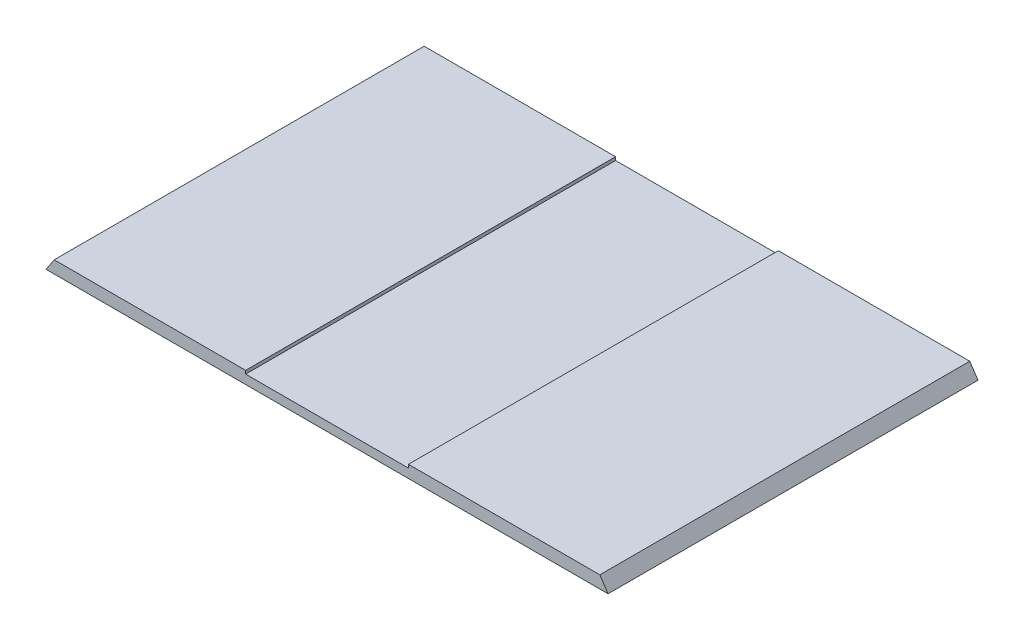
ISO-10303-21;
HEADER;
FILE_DESCRIPTION(('STEP AP214'),'2;1');
FILE_NAME('part.step','',(''),(''),'','','');
FILE_SCHEMA(('AUTOMOTIVE_DESIGN { 1 0 10303 214 1 1 1 1 }'));
ENDSEC;
DATA;
#1=APPLICATION_CONTEXT('core data for automotive mechanical design processes');
#2=APPLICATION_PROTOCOL_DEFINITION('international standard','automotive_design',2000,#1);
#3=PRODUCT_CONTEXT('',#1,'mechanical');
#4=PRODUCT('Part','Part','',(#3));
#5=PRODUCT_RELATED_PRODUCT_CATEGORY('part','',(#4));
#6=PRODUCT_DEFINITION_FORMATION('','',#4);
#7=PRODUCT_DEFINITION_CONTEXT('part definition',#1,'design');
#8=PRODUCT_DEFINITION('design','',#6,#7);
#9=PRODUCT_DEFINITION_SHAPE('','',#8);
#10=(LENGTH_UNIT() NAMED_UNIT(*) SI_UNIT(.MILLI.,.METRE.));
#11=(NAMED_UNIT(*) PLANE_ANGLE_UNIT() SI_UNIT($,.RADIAN.));
#12=(NAMED_UNIT(*) SI_UNIT($,.STERADIAN.) SOLID_ANGLE_UNIT());
#13=UNCERTAINTY_MEASURE_WITH_UNIT(LENGTH_MEASURE(1.E-05),#10,'distance_accuracy_value','');
#14=(GEOMETRIC_REPRESENTATION_CONTEXT(3) GLOBAL_UNCERTAINTY_ASSIGNED_CONTEXT((#13)) GLOBAL_UNIT_ASSIGNED_CONTEXT((#10,
#11,#12)) REPRESENTATION_CONTEXT('',''));
#15=CARTESIAN_POINT('',(0.,0.,0.));
#16=DIRECTION('',(0.,0.,1.));
#17=DIRECTION('',(1.,0.,0.));
#18=AXIS2_PLACEMENT_3D('',#15,#16,#17);
#19=CARTESIAN_POINT('',(341.858259493534,-194.367647058824,450.));
#20=DIRECTION('',(0.,1.,0.));
#21=DIRECTION('',(-1.,0.,0.));
#22=AXIS2_PLACEMENT_3D('',#19,#20,#21);
#23=PLANE('',#22);
#24=DIRECTION('',(1.,0.,0.));
#25=VECTOR('',#24,1.);
#26=CARTESIAN_POINT('',(341.858259493534,-194.367647058824,0.));
#27=LINE('',#26,#25);
#28=CARTESIAN_POINT('',(-341.858259493534,-194.367647058824,0.));
#29=VERTEX_POINT('',#28);
#30=CARTESIAN_POINT('',(341.858259493534,-194.367647058824,0.));
#31=VERTEX_POINT('',#30);
#32=EDGE_CURVE('E129',#29,#31,#27,.T.);
#33=ORIENTED_EDGE('',*,*,#32,.T.);
#34=DIRECTION('',(0.,0.,-1.));
#35=VECTOR('',#34,1.);
#36=CARTESIAN_POINT('',(341.858259493534,-194.367647058824,450.));
#37=LINE('',#36,#35);
#38=CARTESIAN_POINT('',(341.858259493534,-194.367647058824,450.));
#39=VERTEX_POINT('',#38);
#40=EDGE_CURVE('E11',#39,#31,#37,.T.);
#41=ORIENTED_EDGE('',*,*,#40,.F.);
#42=DIRECTION('',(1.,0.,0.));
#43=VECTOR('',#42,1.);
#44=CARTESIAN_POINT('',(341.858259493534,-194.367647058824,450.));
#45=LINE('',#44,#43);
#46=CARTESIAN_POINT('',(-341.858259493534,-194.367647058824,450.));
#47=VERTEX_POINT('',#46);
#48=EDGE_CURVE('E143',#47,#39,#45,.T.);
#49=ORIENTED_EDGE('',*,*,#48,.F.);
#50=DIRECTION('',(0.,0.,-1.));
#51=VECTOR('',#50,1.);
#52=CARTESIAN_POINT('',(-341.858259493534,-194.367647058824,450.));
#53=LINE('',#52,#51);
#54=EDGE_CURVE('E125',#47,#29,#53,.T.);
#55=ORIENTED_EDGE('',*,*,#54,.T.);
#56=EDGE_LOOP('',(#33,#41,#49,#55));
#57=FACE_BOUND('',#56,.T.);
#58=ADVANCED_FACE('F33',(#57),#23,.F.);
#59=CARTESIAN_POINT('',(331.858259493534,-179.367647058824,450.));
#60=DIRECTION('',(-0.832050294337846,-0.554700196225225,0.));
#61=DIRECTION('',(0.554700196225225,-0.832050294337847,0.));
#62=AXIS2_PLACEMENT_3D('',#59,#60,#61);
#63=PLANE('',#62);
#64=DIRECTION('',(-0.554700196225225,0.832050294337846,0.));
#65=VECTOR('',#64,1.);
#66=CARTESIAN_POINT('',(331.858259493534,-179.367647058824,0.));
#67=LINE('',#66,#65);
#68=CARTESIAN_POINT('',(331.858259493534,-179.367647058824,0.));
#69=VERTEX_POINT('',#68);
#70=EDGE_CURVE('E132',#31,#69,#67,.T.);
#71=ORIENTED_EDGE('',*,*,#70,.T.);
#72=DIRECTION('',(0.,0.,-1.));
#73=VECTOR('',#72,1.);
#74=CARTESIAN_POINT('',(331.858259493534,-179.367647058824,450.));
#75=LINE('',#74,#73);
#76=CARTESIAN_POINT('',(331.858259493534,-179.367647058824,450.));
#77=VERTEX_POINT('',#76);
#78=EDGE_CURVE('E41',#77,#69,#75,.T.);
#79=ORIENTED_EDGE('',*,*,#78,.F.);
#80=DIRECTION('',(-0.554700196225225,0.832050294337846,0.));
#81=VECTOR('',#80,1.);
#82=CARTESIAN_POINT('',(331.858259493534,-179.367647058824,450.));
#83=LINE('',#82,#81);
#84=EDGE_CURVE('E92',#39,#77,#83,.T.);
#85=ORIENTED_EDGE('',*,*,#84,.F.);
#86=ORIENTED_EDGE('',*,*,#40,.T.);
#87=EDGE_LOOP('',(#71,#79,#85,#86));
#88=FACE_BOUND('',#87,.T.);
#89=ADVANCED_FACE('F178',(#88),#63,.F.);
#90=CARTESIAN_POINT('',(98.9999999999999,-179.367647058824,450.));
#91=DIRECTION('',(0.,-1.,0.));
#92=DIRECTION('',(1.,0.,0.));
#93=AXIS2_PLACEMENT_3D('',#90,#91,#92);
#94=PLANE('',#93);
#95=DIRECTION('',(-1.,0.,0.));
#96=VECTOR('',#95,1.);
#97=CARTESIAN_POINT('',(98.9999999999999,-179.367647058824,0.));
#98=LINE('',#97,#96);
#99=CARTESIAN_POINT('',(98.9999999999999,-179.367647058824,0.));
#100=VERTEX_POINT('',#99);
#101=EDGE_CURVE('E134',#69,#100,#98,.T.);
#102=ORIENTED_EDGE('',*,*,#101,.T.);
#103=DIRECTION('',(0.,0.,-1.));
#104=VECTOR('',#103,1.);
#105=CARTESIAN_POINT('',(98.9999999999999,-179.367647058824,450.));
#106=LINE('',#105,#104);
#107=CARTESIAN_POINT('',(98.9999999999999,-179.367647058824,450.));
#108=VERTEX_POINT('',#107);
#109=EDGE_CURVE('E150',#108,#100,#106,.T.);
#110=ORIENTED_EDGE('',*,*,#109,.F.);
#111=DIRECTION('',(-1.,0.,0.));
#112=VECTOR('',#111,1.);
#113=CARTESIAN_POINT('',(98.9999999999999,-179.367647058824,450.));
#114=LINE('',#113,#112);
#115=EDGE_CURVE('E158',#77,#108,#114,.T.);
#116=ORIENTED_EDGE('',*,*,#115,.F.);
#117=ORIENTED_EDGE('',*,*,#78,.T.);
#118=EDGE_LOOP('',(#102,#110,#116,#117));
#119=FACE_BOUND('',#118,.T.);
#120=ADVANCED_FACE('F156',(#119),#94,.F.);
#121=CARTESIAN_POINT('',(98.9999999999999,-179.367647058824,450.));
#122=DIRECTION('',(1.,0.,0.));
#123=DIRECTION('',(0.,0.,-1.));
#124=AXIS2_PLACEMENT_3D('',#121,#122,#123);
#125=PLANE('',#124);
#126=DIRECTION('',(0.,-1.,0.));
#127=VECTOR('',#126,1.);
#128=CARTESIAN_POINT('',(98.9999999999999,-179.367647058824,0.));
#129=LINE('',#128,#127);
#130=CARTESIAN_POINT('',(98.9999999999999,-183.367647058824,0.));
#131=VERTEX_POINT('',#130);
#132=EDGE_CURVE('E136',#100,#131,#129,.T.);
#133=ORIENTED_EDGE('',*,*,#132,.T.);
#134=DIRECTION('',(0.,0.,-1.));
#135=VECTOR('',#134,1.);
#136=CARTESIAN_POINT('',(98.9999999999999,-183.367647058824,450.));
#137=LINE('',#136,#135);
#138=CARTESIAN_POINT('',(98.9999999999999,-183.367647058824,450.));
#139=VERTEX_POINT('',#138);
#140=EDGE_CURVE('E147',#139,#131,#137,.T.);
#141=ORIENTED_EDGE('',*,*,#140,.F.);
#142=DIRECTION('',(0.,-1.,0.));
#143=VECTOR('',#142,1.);
#144=CARTESIAN_POINT('',(98.9999999999999,-179.367647058824,450.));
#145=LINE('',#144,#143);
#146=EDGE_CURVE('E170',#108,#139,#145,.T.);
#147=ORIENTED_EDGE('',*,*,#146,.F.);
#148=ORIENTED_EDGE('',*,*,#109,.T.);
#149=EDGE_LOOP('',(#133,#141,#147,#148));
#150=FACE_BOUND('',#149,.T.);
#151=ADVANCED_FACE('F166',(#150),#125,.F.);
#152=CARTESIAN_POINT('',(-98.9999999999999,-183.367647058824,450.));
#153=DIRECTION('',(0.,-1.,0.));
#154=DIRECTION('',(0.,0.,-1.));
#155=AXIS2_PLACEMENT_3D('',#152,#153,#154);
#156=PLANE('',#155);
#157=DIRECTION('',(-1.,0.,0.));
#158=VECTOR('',#157,1.);
#159=CARTESIAN_POINT('',(-98.9999999999999,-183.367647058824,0.));
#160=LINE('',#159,#158);
#161=CARTESIAN_POINT('',(-98.9999999999999,-183.367647058824,0.));
#162=VERTEX_POINT('',#161);
#163=EDGE_CURVE('E138',#131,#162,#160,.T.);
#164=ORIENTED_EDGE('',*,*,#163,.T.);
#165=DIRECTION('',(0.,0.,-1.));
#166=VECTOR('',#165,1.);
#167=CARTESIAN_POINT('',(-98.9999999999999,-183.367647058824,450.));
#168=LINE('',#167,#166);
#169=CARTESIAN_POINT('',(-98.9999999999999,-183.367647058824,450.));
#170=VERTEX_POINT('',#169);
#171=EDGE_CURVE('E120',#170,#162,#168,.T.);
#172=ORIENTED_EDGE('',*,*,#171,.F.);
#173=DIRECTION('',(-1.,0.,0.));
#174=VECTOR('',#173,1.);
#175=CARTESIAN_POINT('',(-98.9999999999999,-183.367647058824,450.));
#176=LINE('',#175,#174);
#177=EDGE_CURVE('E111',#139,#170,#176,.T.);
#178=ORIENTED_EDGE('',*,*,#177,.F.);
#179=ORIENTED_EDGE('',*,*,#140,.T.);
#180=EDGE_LOOP('',(#164,#172,#178,#179));
#181=FACE_BOUND('',#180,.T.);
#182=ADVANCED_FACE('F169',(#181),#156,.F.);
#183=CARTESIAN_POINT('',(-98.9999999999999,-179.367647058824,450.));
#184=DIRECTION('',(-1.,0.,0.));
#185=DIRECTION('',(0.,0.,1.));
#186=AXIS2_PLACEMENT_3D('',#183,#184,#185);
#187=PLANE('',#186);
#188=DIRECTION('',(0.,1.,0.));
#189=VECTOR('',#188,1.);
#190=CARTESIAN_POINT('',(-98.9999999999999,-179.367647058824,0.));
#191=LINE('',#190,#189);
#192=CARTESIAN_POINT('',(-98.9999999999999,-179.367647058824,0.));
#193=VERTEX_POINT('',#192);
#194=EDGE_CURVE('E119',#162,#193,#191,.T.);
#195=ORIENTED_EDGE('',*,*,#194,.T.);
#196=DIRECTION('',(0.,0.,-1.));
#197=VECTOR('',#196,1.);
#198=CARTESIAN_POINT('',(-98.9999999999999,-179.367647058824,450.));
#199=LINE('',#198,#197);
#200=CARTESIAN_POINT('',(-98.9999999999999,-179.367647058824,450.));
#201=VERTEX_POINT('',#200);
#202=EDGE_CURVE('E116',#201,#193,#199,.T.);
#203=ORIENTED_EDGE('',*,*,#202,.F.);
#204=DIRECTION('',(0.,1.,0.));
#205=VECTOR('',#204,1.);
#206=CARTESIAN_POINT('',(-98.9999999999999,-179.367647058824,450.));
#207=LINE('',#206,#205);
#208=EDGE_CURVE('E105',#170,#201,#207,.T.);
#209=ORIENTED_EDGE('',*,*,#208,.F.);
#210=ORIENTED_EDGE('',*,*,#171,.T.);
#211=EDGE_LOOP('',(#195,#203,#209,#210));
#212=FACE_BOUND('',#211,.T.);
#213=ADVANCED_FACE('F117',(#212),#187,.F.);
#214=CARTESIAN_POINT('',(-98.9999999999999,-179.367647058824,450.));
#215=DIRECTION('',(0.,-1.,0.));
#216=DIRECTION('',(1.,0.,0.));
#217=AXIS2_PLACEMENT_3D('',#214,#215,#216);
#218=PLANE('',#217);
#219=DIRECTION('',(-1.,0.,0.));
#220=VECTOR('',#219,1.);
#221=CARTESIAN_POINT('',(-98.9999999999999,-179.367647058824,0.));
#222=LINE('',#221,#220);
#223=CARTESIAN_POINT('',(-331.858259493534,-179.367647058824,0.));
#224=VERTEX_POINT('',#223);
#225=EDGE_CURVE('E78',#193,#224,#222,.T.);
#226=ORIENTED_EDGE('',*,*,#225,.T.);
#227=DIRECTION('',(0.,0.,-1.));
#228=VECTOR('',#227,1.);
#229=CARTESIAN_POINT('',(-331.858259493534,-179.367647058824,450.));
#230=LINE('',#229,#228);
#231=CARTESIAN_POINT('',(-331.858259493534,-179.367647058824,450.));
#232=VERTEX_POINT('',#231);
#233=EDGE_CURVE('E121',#232,#224,#230,.T.);
#234=ORIENTED_EDGE('',*,*,#233,.F.);
#235=DIRECTION('',(-1.,0.,0.));
#236=VECTOR('',#235,1.);
#237=CARTESIAN_POINT('',(-98.9999999999999,-179.367647058824,450.));
#238=LINE('',#237,#236);
#239=EDGE_CURVE('E109',#201,#232,#238,.T.);
#240=ORIENTED_EDGE('',*,*,#239,.F.);
#241=ORIENTED_EDGE('',*,*,#202,.T.);
#242=EDGE_LOOP('',(#226,#234,#240,#241));
#243=FACE_BOUND('',#242,.T.);
#244=ADVANCED_FACE('F123',(#243),#218,.F.);
#245=CARTESIAN_POINT('',(-331.858259493534,-179.367647058824,450.));
#246=DIRECTION('',(0.832050294337846,-0.554700196225225,0.));
#247=DIRECTION('',(0.554700196225225,0.832050294337847,0.));
#248=AXIS2_PLACEMENT_3D('',#245,#246,#247);
#249=PLANE('',#248);
#250=DIRECTION('',(-0.554700196225225,-0.832050294337846,0.));
#251=VECTOR('',#250,1.);
#252=CARTESIAN_POINT('',(-331.858259493534,-179.367647058824,0.));
#253=LINE('',#252,#251);
#254=EDGE_CURVE('E84',#224,#29,#253,.T.);
#255=ORIENTED_EDGE('',*,*,#254,.T.);
#256=ORIENTED_EDGE('',*,*,#54,.F.);
#257=DIRECTION('',(-0.554700196225225,-0.832050294337846,0.));
#258=VECTOR('',#257,1.);
#259=CARTESIAN_POINT('',(-331.858259493534,-179.367647058824,450.));
#260=LINE('',#259,#258);
#261=EDGE_CURVE('E49',#232,#47,#260,.T.);
#262=ORIENTED_EDGE('',*,*,#261,.F.);
#263=ORIENTED_EDGE('',*,*,#233,.T.);
#264=EDGE_LOOP('',(#255,#256,#262,#263));
#265=FACE_BOUND('',#264,.T.);
#266=ADVANCED_FACE('F194',(#265),#249,.F.);
#267=CARTESIAN_POINT('',(0.,0.,450.));
#268=DIRECTION('',(0.,0.,1.));
#269=DIRECTION('',(1.,0.,0.));
#270=AXIS2_PLACEMENT_3D('',#267,#268,#269);
#271=PLANE('',#270);
#272=ORIENTED_EDGE('',*,*,#48,.T.);
#273=ORIENTED_EDGE('',*,*,#84,.T.);
#274=ORIENTED_EDGE('',*,*,#115,.T.);
#275=ORIENTED_EDGE('',*,*,#146,.T.);
#276=ORIENTED_EDGE('',*,*,#177,.T.);
#277=ORIENTED_EDGE('',*,*,#208,.T.);
#278=ORIENTED_EDGE('',*,*,#239,.T.);
#279=ORIENTED_EDGE('',*,*,#261,.T.);
#280=EDGE_LOOP('',(#272,#273,#274,#275,#276,#277,#278,#279));
#281=FACE_BOUND('',#280,.T.);
#282=ADVANCED_FACE('F107',(#281),#271,.T.);
#283=CARTESIAN_POINT('',(0.,0.,0.));
#284=DIRECTION('',(0.,0.,1.));
#285=DIRECTION('',(1.,0.,0.));
#286=AXIS2_PLACEMENT_3D('',#283,#284,#285);
#287=PLANE('',#286);
#288=ORIENTED_EDGE('',*,*,#32,.F.);
#289=ORIENTED_EDGE('',*,*,#254,.F.);
#290=ORIENTED_EDGE('',*,*,#225,.F.);
#291=ORIENTED_EDGE('',*,*,#194,.F.);
#292=ORIENTED_EDGE('',*,*,#163,.F.);
#293=ORIENTED_EDGE('',*,*,#132,.F.);
#294=ORIENTED_EDGE('',*,*,#101,.F.);
#295=ORIENTED_EDGE('',*,*,#70,.F.);
#296=EDGE_LOOP('',(#288,#289,#290,#291,#292,#293,#294,#295));
#297=FACE_BOUND('',#296,.T.);
#298=ADVANCED_FACE('F162',(#297),#287,.F.);
#299=CLOSED_SHELL('',(#58,#89,#120,#151,#182,#213,#244,#266,#282,#298));
#300=MANIFOLD_SOLID_BREP('B2',#299);
#301=ADVANCED_BREP_SHAPE_REPRESENTATION('',(#18,#300),#14);
#302=SHAPE_DEFINITION_REPRESENTATION(#9,#301);
ENDSEC;
END-ISO-10303-21;
